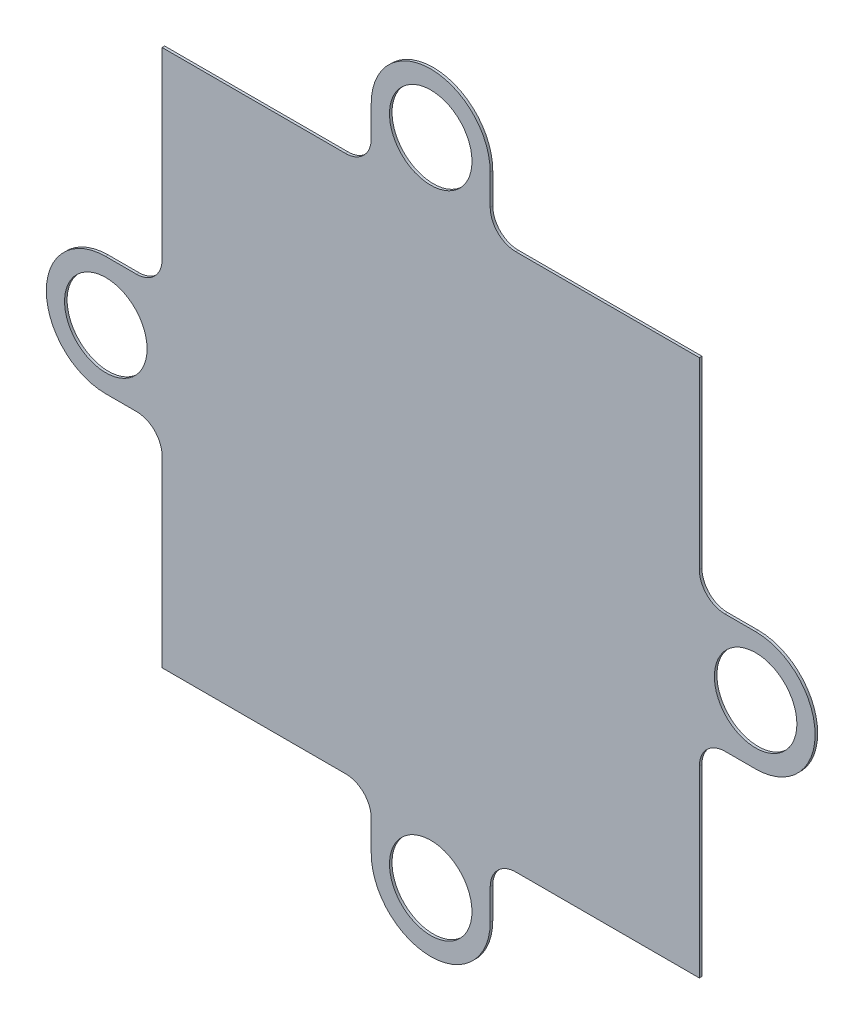
ISO-10303-21;
HEADER;
FILE_DESCRIPTION(('STEP AP214'),'2;1');
FILE_NAME('part.step','',(''),(''),'','','');
FILE_SCHEMA(('AUTOMOTIVE_DESIGN { 1 0 10303 214 1 1 1 1 }'));
ENDSEC;
DATA;
#1=APPLICATION_CONTEXT('core data for automotive mechanical design processes');
#2=APPLICATION_PROTOCOL_DEFINITION('international standard','automotive_design',2000,#1);
#3=PRODUCT_CONTEXT('',#1,'mechanical');
#4=PRODUCT('Part','Part','',(#3));
#5=PRODUCT_RELATED_PRODUCT_CATEGORY('part','',(#4));
#6=PRODUCT_DEFINITION_FORMATION('','',#4);
#7=PRODUCT_DEFINITION_CONTEXT('part definition',#1,'design');
#8=PRODUCT_DEFINITION('design','',#6,#7);
#9=PRODUCT_DEFINITION_SHAPE('','',#8);
#10=(LENGTH_UNIT() NAMED_UNIT(*) SI_UNIT(.MILLI.,.METRE.));
#11=(NAMED_UNIT(*) PLANE_ANGLE_UNIT() SI_UNIT($,.RADIAN.));
#12=(NAMED_UNIT(*) SI_UNIT($,.STERADIAN.) SOLID_ANGLE_UNIT());
#13=UNCERTAINTY_MEASURE_WITH_UNIT(LENGTH_MEASURE(1.E-05),#10,'distance_accuracy_value','');
#14=(GEOMETRIC_REPRESENTATION_CONTEXT(3) GLOBAL_UNCERTAINTY_ASSIGNED_CONTEXT((#13)) GLOBAL_UNIT_ASSIGNED_CONTEXT((#10,
#11,#12)) REPRESENTATION_CONTEXT('',''));
#15=CARTESIAN_POINT('',(0.,0.,0.));
#16=DIRECTION('',(0.,0.,1.));
#17=DIRECTION('',(1.,0.,0.));
#18=AXIS2_PLACEMENT_3D('',#15,#16,#17);
#19=CARTESIAN_POINT('',(0.,-4.64999999999974,0.2));
#20=DIRECTION('',(0.,1.,0.));
#21=DIRECTION('',(0.,0.,1.));
#22=AXIS2_PLACEMENT_3D('',#19,#20,#21);
#23=PLANE('',#22);
#24=DIRECTION('',(1.,0.,0.));
#25=VECTOR('',#24,1.);
#26=CARTESIAN_POINT('',(0.,-4.64999999999974,0.));
#27=LINE('',#26,#25);
#28=CARTESIAN_POINT('',(-25.4000000000001,-4.64999999999974,0.));
#29=VERTEX_POINT('',#28);
#30=CARTESIAN_POINT('',(-23.0000000000001,-4.64999999999974,0.));
#31=VERTEX_POINT('',#30);
#32=EDGE_CURVE('E284',#29,#31,#27,.T.);
#33=ORIENTED_EDGE('',*,*,#32,.T.);
#34=DIRECTION('',(0.,0.,-1.));
#35=VECTOR('',#34,1.);
#36=CARTESIAN_POINT('',(-23.0000000000001,-4.64999999999974,0.2));
#37=LINE('',#36,#35);
#38=CARTESIAN_POINT('',(-23.0000000000001,-4.64999999999974,0.2));
#39=VERTEX_POINT('',#38);
#40=EDGE_CURVE('E11',#39,#31,#37,.T.);
#41=ORIENTED_EDGE('',*,*,#40,.F.);
#42=DIRECTION('',(1.,0.,0.));
#43=VECTOR('',#42,1.);
#44=CARTESIAN_POINT('',(0.,-4.64999999999974,0.2));
#45=LINE('',#44,#43);
#46=CARTESIAN_POINT('',(-25.4000000000001,-4.64999999999974,0.2));
#47=VERTEX_POINT('',#46);
#48=EDGE_CURVE('E490',#47,#39,#45,.T.);
#49=ORIENTED_EDGE('',*,*,#48,.F.);
#50=DIRECTION('',(0.,0.,-1.));
#51=VECTOR('',#50,1.);
#52=CARTESIAN_POINT('',(-25.4000000000001,-4.64999999999974,0.2));
#53=LINE('',#52,#51);
#54=EDGE_CURVE('E264',#47,#29,#53,.T.);
#55=ORIENTED_EDGE('',*,*,#54,.T.);
#56=EDGE_LOOP('',(#33,#41,#49,#55));
#57=FACE_BOUND('',#56,.T.);
#58=ADVANCED_FACE('F47',(#57),#23,.F.);
#59=CARTESIAN_POINT('',(-23.0000000000001,-6.64999999999976,0.2));
#60=DIRECTION('',(0.,0.,-1.));
#61=DIRECTION('',(-1.,0.,0.));
#62=AXIS2_PLACEMENT_3D('',#59,#60,#61);
#63=CYLINDRICAL_SURFACE('',#62,2.00000000000001);
#64=CARTESIAN_POINT('',(-23.0000000000001,-6.64999999999976,0.));
#65=DIRECTION('',(0.,0.,1.));
#66=DIRECTION('',(1.,0.,0.));
#67=AXIS2_PLACEMENT_3D('',#64,#65,#66);
#68=CIRCLE('',#67,2.00000000000001);
#69=CARTESIAN_POINT('',(-21.0000000000001,-6.6499999999998,0.));
#70=VERTEX_POINT('',#69);
#71=EDGE_CURVE('E288',#31,#70,#68,.F.);
#72=ORIENTED_EDGE('',*,*,#71,.T.);
#73=DIRECTION('',(0.,0.,-1.));
#74=VECTOR('',#73,1.);
#75=CARTESIAN_POINT('',(-21.0000000000001,-6.6499999999998,0.2));
#76=LINE('',#75,#74);
#77=CARTESIAN_POINT('',(-21.0000000000001,-6.6499999999998,0.2));
#78=VERTEX_POINT('',#77);
#79=EDGE_CURVE('E57',#78,#70,#76,.T.);
#80=ORIENTED_EDGE('',*,*,#79,.F.);
#81=CARTESIAN_POINT('',(-23.0000000000001,-6.64999999999976,0.2));
#82=DIRECTION('',(0.,0.,1.));
#83=DIRECTION('',(1.,0.,0.));
#84=AXIS2_PLACEMENT_3D('',#81,#82,#83);
#85=CIRCLE('',#84,2.00000000000001);
#86=EDGE_CURVE('E164',#39,#78,#85,.F.);
#87=ORIENTED_EDGE('',*,*,#86,.F.);
#88=ORIENTED_EDGE('',*,*,#40,.T.);
#89=EDGE_LOOP('',(#72,#80,#87,#88));
#90=FACE_BOUND('',#89,.T.);
#91=ADVANCED_FACE('F470',(#90),#63,.F.);
#92=CARTESIAN_POINT('',(-21.0000000000001,-1.01544788837666E-13,0.2));
#93=DIRECTION('',(-1.,0.,0.));
#94=DIRECTION('',(0.,-1.,0.));
#95=AXIS2_PLACEMENT_3D('',#92,#93,#94);
#96=PLANE('',#95);
#97=DIRECTION('',(0.,1.,0.));
#98=VECTOR('',#97,1.);
#99=CARTESIAN_POINT('',(-21.0000000000001,-1.01544788837666E-13,0.));
#100=LINE('',#99,#98);
#101=CARTESIAN_POINT('',(-21.,-21.,0.));
#102=VERTEX_POINT('',#101);
#103=EDGE_CURVE('E292',#102,#70,#100,.T.);
#104=ORIENTED_EDGE('',*,*,#103,.F.);
#105=DIRECTION('',(0.,0.,-1.));
#106=VECTOR('',#105,1.);
#107=CARTESIAN_POINT('',(-21.,-21.,0.2));
#108=LINE('',#107,#106);
#109=CARTESIAN_POINT('',(-21.,-21.,0.2));
#110=VERTEX_POINT('',#109);
#111=EDGE_CURVE('E461',#110,#102,#108,.T.);
#112=ORIENTED_EDGE('',*,*,#111,.F.);
#113=DIRECTION('',(0.,1.,0.));
#114=VECTOR('',#113,1.);
#115=CARTESIAN_POINT('',(-21.0000000000001,-1.01544788837666E-13,0.2));
#116=LINE('',#115,#114);
#117=EDGE_CURVE('E469',#110,#78,#116,.T.);
#118=ORIENTED_EDGE('',*,*,#117,.T.);
#119=ORIENTED_EDGE('',*,*,#79,.T.);
#120=EDGE_LOOP('',(#104,#112,#118,#119));
#121=FACE_BOUND('',#120,.T.);
#122=ADVANCED_FACE('F467',(#121),#96,.T.);
#123=CARTESIAN_POINT('',(1.827806199078E-13,-20.9999999999998,0.2));
#124=DIRECTION('',(0.,1.,0.));
#125=DIRECTION('',(-1.,0.,0.));
#126=AXIS2_PLACEMENT_3D('',#123,#124,#125);
#127=PLANE('',#126);
#128=DIRECTION('',(1.,0.,0.));
#129=VECTOR('',#128,1.);
#130=CARTESIAN_POINT('',(1.827806199078E-13,-20.9999999999998,0.));
#131=LINE('',#130,#129);
#132=CARTESIAN_POINT('',(-6.65000000000012,-20.9999999999999,0.));
#133=VERTEX_POINT('',#132);
#134=EDGE_CURVE('E296',#102,#133,#131,.T.);
#135=ORIENTED_EDGE('',*,*,#134,.T.);
#136=DIRECTION('',(0.,0.,-1.));
#137=VECTOR('',#136,1.);
#138=CARTESIAN_POINT('',(-6.65000000000012,-20.9999999999999,0.2));
#139=LINE('',#138,#137);
#140=CARTESIAN_POINT('',(-6.65000000000012,-20.9999999999999,0.2));
#141=VERTEX_POINT('',#140);
#142=EDGE_CURVE('E458',#141,#133,#139,.T.);
#143=ORIENTED_EDGE('',*,*,#142,.F.);
#144=DIRECTION('',(1.,0.,0.));
#145=VECTOR('',#144,1.);
#146=CARTESIAN_POINT('',(1.827806199078E-13,-20.9999999999998,0.2));
#147=LINE('',#146,#145);
#148=EDGE_CURVE('E482',#110,#141,#147,.T.);
#149=ORIENTED_EDGE('',*,*,#148,.F.);
#150=ORIENTED_EDGE('',*,*,#111,.T.);
#151=EDGE_LOOP('',(#135,#143,#149,#150));
#152=FACE_BOUND('',#151,.T.);
#153=ADVANCED_FACE('F479',(#152),#127,.F.);
#154=CARTESIAN_POINT('',(-6.65000000000008,-22.9999999999999,0.2));
#155=DIRECTION('',(0.,0.,-1.));
#156=DIRECTION('',(-1.,0.,0.));
#157=AXIS2_PLACEMENT_3D('',#154,#155,#156);
#158=CYLINDRICAL_SURFACE('',#157,2.);
#159=CARTESIAN_POINT('',(-6.65000000000008,-22.9999999999999,0.));
#160=DIRECTION('',(0.,0.,1.));
#161=DIRECTION('',(1.,0.,0.));
#162=AXIS2_PLACEMENT_3D('',#159,#160,#161);
#163=CIRCLE('',#162,2.);
#164=CARTESIAN_POINT('',(-4.65000000000009,-22.9999999999999,0.));
#165=VERTEX_POINT('',#164);
#166=EDGE_CURVE('E300',#165,#133,#163,.T.);
#167=ORIENTED_EDGE('',*,*,#166,.F.);
#168=DIRECTION('',(0.,0.,-1.));
#169=VECTOR('',#168,1.);
#170=CARTESIAN_POINT('',(-4.65000000000009,-22.9999999999999,0.2));
#171=LINE('',#170,#169);
#172=CARTESIAN_POINT('',(-4.65000000000009,-22.9999999999999,0.2));
#173=VERTEX_POINT('',#172);
#174=EDGE_CURVE('E455',#173,#165,#171,.T.);
#175=ORIENTED_EDGE('',*,*,#174,.F.);
#176=CARTESIAN_POINT('',(-6.65000000000008,-22.9999999999999,0.2));
#177=DIRECTION('',(0.,0.,1.));
#178=DIRECTION('',(1.,0.,0.));
#179=AXIS2_PLACEMENT_3D('',#176,#177,#178);
#180=CIRCLE('',#179,2.);
#181=EDGE_CURVE('E485',#173,#141,#180,.T.);
#182=ORIENTED_EDGE('',*,*,#181,.T.);
#183=ORIENTED_EDGE('',*,*,#142,.T.);
#184=EDGE_LOOP('',(#167,#175,#182,#183));
#185=FACE_BOUND('',#184,.T.);
#186=ADVANCED_FACE('F843',(#185),#158,.F.);
#187=CARTESIAN_POINT('',(-4.65000000000009,0.,0.2));
#188=DIRECTION('',(-1.,0.,0.));
#189=DIRECTION('',(0.,0.,1.));
#190=AXIS2_PLACEMENT_3D('',#187,#188,#189);
#191=PLANE('',#190);
#192=DIRECTION('',(0.,1.,0.));
#193=VECTOR('',#192,1.);
#194=CARTESIAN_POINT('',(-4.65000000000009,0.,0.));
#195=LINE('',#194,#193);
#196=CARTESIAN_POINT('',(-4.65000000000009,-25.4,0.));
#197=VERTEX_POINT('',#196);
#198=EDGE_CURVE('E304',#197,#165,#195,.T.);
#199=ORIENTED_EDGE('',*,*,#198,.F.);
#200=DIRECTION('',(0.,0.,-1.));
#201=VECTOR('',#200,1.);
#202=CARTESIAN_POINT('',(-4.65000000000009,-25.4,0.2));
#203=LINE('',#202,#201);
#204=CARTESIAN_POINT('',(-4.65000000000009,-25.4,0.2));
#205=VERTEX_POINT('',#204);
#206=EDGE_CURVE('E452',#205,#197,#203,.T.);
#207=ORIENTED_EDGE('',*,*,#206,.F.);
#208=DIRECTION('',(0.,1.,0.));
#209=VECTOR('',#208,1.);
#210=CARTESIAN_POINT('',(-4.65000000000009,0.,0.2));
#211=LINE('',#210,#209);
#212=EDGE_CURVE('E496',#205,#173,#211,.T.);
#213=ORIENTED_EDGE('',*,*,#212,.T.);
#214=ORIENTED_EDGE('',*,*,#174,.T.);
#215=EDGE_LOOP('',(#199,#207,#213,#214));
#216=FACE_BOUND('',#215,.T.);
#217=ADVANCED_FACE('F834',(#216),#191,.T.);
#218=CARTESIAN_POINT('',(0.,-25.4,0.2));
#219=DIRECTION('',(0.,0.,-1.));
#220=DIRECTION('',(-1.,0.,0.));
#221=AXIS2_PLACEMENT_3D('',#218,#219,#220);
#222=CYLINDRICAL_SURFACE('',#221,4.65);
#223=CARTESIAN_POINT('',(0.,-25.4,0.));
#224=DIRECTION('',(0.,0.,1.));
#225=DIRECTION('',(1.,0.,0.));
#226=AXIS2_PLACEMENT_3D('',#223,#224,#225);
#227=CIRCLE('',#226,4.65);
#228=CARTESIAN_POINT('',(4.64999999999991,-25.4,0.));
#229=VERTEX_POINT('',#228);
#230=EDGE_CURVE('E308',#197,#229,#227,.T.);
#231=ORIENTED_EDGE('',*,*,#230,.T.);
#232=DIRECTION('',(0.,0.,-1.));
#233=VECTOR('',#232,1.);
#234=CARTESIAN_POINT('',(4.64999999999991,-25.4,0.2));
#235=LINE('',#234,#233);
#236=CARTESIAN_POINT('',(4.64999999999991,-25.4,0.2));
#237=VERTEX_POINT('',#236);
#238=EDGE_CURVE('E448',#237,#229,#235,.T.);
#239=ORIENTED_EDGE('',*,*,#238,.F.);
#240=CARTESIAN_POINT('',(0.,-25.4,0.2));
#241=DIRECTION('',(0.,0.,1.));
#242=DIRECTION('',(1.,0.,0.));
#243=AXIS2_PLACEMENT_3D('',#240,#241,#242);
#244=CIRCLE('',#243,4.65);
#245=EDGE_CURVE('E500',#205,#237,#244,.T.);
#246=ORIENTED_EDGE('',*,*,#245,.F.);
#247=ORIENTED_EDGE('',*,*,#206,.T.);
#248=EDGE_LOOP('',(#231,#239,#246,#247));
#249=FACE_BOUND('',#248,.T.);
#250=ADVANCED_FACE('F825',(#249),#222,.T.);
#251=CARTESIAN_POINT('',(4.64999999999991,0.,0.2));
#252=DIRECTION('',(-1.,0.,0.));
#253=DIRECTION('',(0.,0.,1.));
#254=AXIS2_PLACEMENT_3D('',#251,#252,#253);
#255=PLANE('',#254);
#256=DIRECTION('',(0.,1.,0.));
#257=VECTOR('',#256,1.);
#258=CARTESIAN_POINT('',(4.64999999999991,0.,0.));
#259=LINE('',#258,#257);
#260=CARTESIAN_POINT('',(4.64999999999991,-22.9999999999999,0.));
#261=VERTEX_POINT('',#260);
#262=EDGE_CURVE('E311',#229,#261,#259,.T.);
#263=ORIENTED_EDGE('',*,*,#262,.T.);
#264=DIRECTION('',(0.,0.,-1.));
#265=VECTOR('',#264,1.);
#266=CARTESIAN_POINT('',(4.64999999999991,-22.9999999999999,0.2));
#267=LINE('',#266,#265);
#268=CARTESIAN_POINT('',(4.64999999999991,-22.9999999999999,0.2));
#269=VERTEX_POINT('',#268);
#270=EDGE_CURVE('E444',#269,#261,#267,.T.);
#271=ORIENTED_EDGE('',*,*,#270,.F.);
#272=DIRECTION('',(0.,1.,0.));
#273=VECTOR('',#272,1.);
#274=CARTESIAN_POINT('',(4.64999999999991,0.,0.2));
#275=LINE('',#274,#273);
#276=EDGE_CURVE('E503',#237,#269,#275,.T.);
#277=ORIENTED_EDGE('',*,*,#276,.F.);
#278=ORIENTED_EDGE('',*,*,#238,.T.);
#279=EDGE_LOOP('',(#263,#271,#277,#278));
#280=FACE_BOUND('',#279,.T.);
#281=ADVANCED_FACE('F816',(#280),#255,.F.);
#282=CARTESIAN_POINT('',(6.6499999999999,-22.9999999999999,0.2));
#283=DIRECTION('',(0.,0.,-1.));
#284=DIRECTION('',(-1.,0.,0.));
#285=AXIS2_PLACEMENT_3D('',#282,#283,#284);
#286=CYLINDRICAL_SURFACE('',#285,2.);
#287=CARTESIAN_POINT('',(6.6499999999999,-22.9999999999999,0.));
#288=DIRECTION('',(0.,0.,1.));
#289=DIRECTION('',(1.,0.,0.));
#290=AXIS2_PLACEMENT_3D('',#287,#288,#289);
#291=CIRCLE('',#290,2.);
#292=CARTESIAN_POINT('',(6.64999999999994,-20.9999999999999,0.));
#293=VERTEX_POINT('',#292);
#294=EDGE_CURVE('E314',#261,#293,#291,.F.);
#295=ORIENTED_EDGE('',*,*,#294,.T.);
#296=DIRECTION('',(0.,0.,-1.));
#297=VECTOR('',#296,1.);
#298=CARTESIAN_POINT('',(6.64999999999994,-20.9999999999999,0.2));
#299=LINE('',#298,#297);
#300=CARTESIAN_POINT('',(6.64999999999994,-20.9999999999999,0.2));
#301=VERTEX_POINT('',#300);
#302=EDGE_CURVE('E440',#301,#293,#299,.T.);
#303=ORIENTED_EDGE('',*,*,#302,.F.);
#304=CARTESIAN_POINT('',(6.6499999999999,-22.9999999999999,0.2));
#305=DIRECTION('',(0.,0.,1.));
#306=DIRECTION('',(1.,0.,0.));
#307=AXIS2_PLACEMENT_3D('',#304,#305,#306);
#308=CIRCLE('',#307,2.);
#309=EDGE_CURVE('E506',#269,#301,#308,.F.);
#310=ORIENTED_EDGE('',*,*,#309,.F.);
#311=ORIENTED_EDGE('',*,*,#270,.T.);
#312=EDGE_LOOP('',(#295,#303,#310,#311));
#313=FACE_BOUND('',#312,.T.);
#314=ADVANCED_FACE('F807',(#313),#286,.F.);
#315=CARTESIAN_POINT('',(0.,-20.9999999999999,0.2));
#316=DIRECTION('',(0.,1.,0.));
#317=DIRECTION('',(0.,0.,1.));
#318=AXIS2_PLACEMENT_3D('',#315,#316,#317);
#319=PLANE('',#318);
#320=DIRECTION('',(1.,0.,0.));
#321=VECTOR('',#320,1.);
#322=CARTESIAN_POINT('',(0.,-20.9999999999999,0.));
#323=LINE('',#322,#321);
#324=CARTESIAN_POINT('',(21.,-21.,0.));
#325=VERTEX_POINT('',#324);
#326=EDGE_CURVE('E317',#293,#325,#323,.T.);
#327=ORIENTED_EDGE('',*,*,#326,.T.);
#328=DIRECTION('',(0.,0.,-1.));
#329=VECTOR('',#328,1.);
#330=CARTESIAN_POINT('',(21.,-21.,0.2));
#331=LINE('',#330,#329);
#332=CARTESIAN_POINT('',(21.,-21.,0.2));
#333=VERTEX_POINT('',#332);
#334=EDGE_CURVE('E436',#333,#325,#331,.T.);
#335=ORIENTED_EDGE('',*,*,#334,.F.);
#336=DIRECTION('',(1.,0.,0.));
#337=VECTOR('',#336,1.);
#338=CARTESIAN_POINT('',(0.,-20.9999999999999,0.2));
#339=LINE('',#338,#337);
#340=EDGE_CURVE('E509',#301,#333,#339,.T.);
#341=ORIENTED_EDGE('',*,*,#340,.F.);
#342=ORIENTED_EDGE('',*,*,#302,.T.);
#343=EDGE_LOOP('',(#327,#335,#341,#342));
#344=FACE_BOUND('',#343,.T.);
#345=ADVANCED_FACE('F798',(#344),#319,.F.);
#346=CARTESIAN_POINT('',(21.,0.,0.2));
#347=DIRECTION('',(-1.,0.,0.));
#348=DIRECTION('',(0.,-1.,0.));
#349=AXIS2_PLACEMENT_3D('',#346,#347,#348);
#350=PLANE('',#349);
#351=DIRECTION('',(0.,1.,0.));
#352=VECTOR('',#351,1.);
#353=CARTESIAN_POINT('',(21.,0.,0.));
#354=LINE('',#353,#352);
#355=CARTESIAN_POINT('',(21.,-6.6500000000001,0.));
#356=VERTEX_POINT('',#355);
#357=EDGE_CURVE('E320',#325,#356,#354,.T.);
#358=ORIENTED_EDGE('',*,*,#357,.T.);
#359=DIRECTION('',(0.,0.,-1.));
#360=VECTOR('',#359,1.);
#361=CARTESIAN_POINT('',(21.,-6.6500000000001,0.2));
#362=LINE('',#361,#360);
#363=CARTESIAN_POINT('',(21.,-6.6500000000001,0.2));
#364=VERTEX_POINT('',#363);
#365=EDGE_CURVE('E433',#364,#356,#362,.T.);
#366=ORIENTED_EDGE('',*,*,#365,.F.);
#367=DIRECTION('',(0.,1.,0.));
#368=VECTOR('',#367,1.);
#369=CARTESIAN_POINT('',(21.,0.,0.2));
#370=LINE('',#369,#368);
#371=EDGE_CURVE('E512',#333,#364,#370,.T.);
#372=ORIENTED_EDGE('',*,*,#371,.F.);
#373=ORIENTED_EDGE('',*,*,#334,.T.);
#374=EDGE_LOOP('',(#358,#366,#372,#373));
#375=FACE_BOUND('',#374,.T.);
#376=ADVANCED_FACE('F789',(#375),#350,.F.);
#377=CARTESIAN_POINT('',(23.,-6.65000000000009,0.2));
#378=DIRECTION('',(0.,0.,-1.));
#379=DIRECTION('',(-1.,0.,0.));
#380=AXIS2_PLACEMENT_3D('',#377,#378,#379);
#381=CYLINDRICAL_SURFACE('',#380,2.);
#382=CARTESIAN_POINT('',(23.,-6.65000000000009,0.));
#383=DIRECTION('',(0.,0.,1.));
#384=DIRECTION('',(1.,0.,0.));
#385=AXIS2_PLACEMENT_3D('',#382,#383,#384);
#386=CIRCLE('',#385,2.);
#387=CARTESIAN_POINT('',(23.,-4.6500000000001,0.));
#388=VERTEX_POINT('',#387);
#389=EDGE_CURVE('E324',#388,#356,#386,.T.);
#390=ORIENTED_EDGE('',*,*,#389,.F.);
#391=DIRECTION('',(0.,0.,-1.));
#392=VECTOR('',#391,1.);
#393=CARTESIAN_POINT('',(23.,-4.6500000000001,0.2));
#394=LINE('',#393,#392);
#395=CARTESIAN_POINT('',(23.,-4.6500000000001,0.2));
#396=VERTEX_POINT('',#395);
#397=EDGE_CURVE('E430',#396,#388,#394,.T.);
#398=ORIENTED_EDGE('',*,*,#397,.F.);
#399=CARTESIAN_POINT('',(23.,-6.65000000000009,0.2));
#400=DIRECTION('',(0.,0.,1.));
#401=DIRECTION('',(1.,0.,0.));
#402=AXIS2_PLACEMENT_3D('',#399,#400,#401);
#403=CIRCLE('',#402,2.);
#404=EDGE_CURVE('E515',#396,#364,#403,.T.);
#405=ORIENTED_EDGE('',*,*,#404,.T.);
#406=ORIENTED_EDGE('',*,*,#365,.T.);
#407=EDGE_LOOP('',(#390,#398,#405,#406));
#408=FACE_BOUND('',#407,.T.);
#409=ADVANCED_FACE('F780',(#408),#381,.F.);
#410=CARTESIAN_POINT('',(0.,-4.6500000000001,0.2));
#411=DIRECTION('',(0.,-1.,0.));
#412=DIRECTION('',(0.,0.,-1.));
#413=AXIS2_PLACEMENT_3D('',#410,#411,#412);
#414=PLANE('',#413);
#415=DIRECTION('',(-1.,0.,0.));
#416=VECTOR('',#415,1.);
#417=CARTESIAN_POINT('',(0.,-4.6500000000001,0.));
#418=LINE('',#417,#416);
#419=CARTESIAN_POINT('',(25.4000000000001,-4.6500000000001,0.));
#420=VERTEX_POINT('',#419);
#421=EDGE_CURVE('E328',#420,#388,#418,.T.);
#422=ORIENTED_EDGE('',*,*,#421,.F.);
#423=DIRECTION('',(0.,0.,-1.));
#424=VECTOR('',#423,1.);
#425=CARTESIAN_POINT('',(25.4000000000001,-4.6500000000001,0.2));
#426=LINE('',#425,#424);
#427=CARTESIAN_POINT('',(25.4000000000001,-4.6500000000001,0.2));
#428=VERTEX_POINT('',#427);
#429=EDGE_CURVE('E427',#428,#420,#426,.T.);
#430=ORIENTED_EDGE('',*,*,#429,.F.);
#431=DIRECTION('',(-1.,0.,0.));
#432=VECTOR('',#431,1.);
#433=CARTESIAN_POINT('',(0.,-4.6500000000001,0.2));
#434=LINE('',#433,#432);
#435=EDGE_CURVE('E519',#428,#396,#434,.T.);
#436=ORIENTED_EDGE('',*,*,#435,.T.);
#437=ORIENTED_EDGE('',*,*,#397,.T.);
#438=EDGE_LOOP('',(#422,#430,#436,#437));
#439=FACE_BOUND('',#438,.T.);
#440=ADVANCED_FACE('F771',(#439),#414,.T.);
#441=CARTESIAN_POINT('',(25.4000000000001,0.,0.2));
#442=DIRECTION('',(0.,0.,-1.));
#443=DIRECTION('',(-1.,0.,0.));
#444=AXIS2_PLACEMENT_3D('',#441,#442,#443);
#445=CYLINDRICAL_SURFACE('',#444,4.65);
#446=CARTESIAN_POINT('',(25.4000000000001,0.,0.));
#447=DIRECTION('',(0.,0.,1.));
#448=DIRECTION('',(1.,0.,0.));
#449=AXIS2_PLACEMENT_3D('',#446,#447,#448);
#450=CIRCLE('',#449,4.65);
#451=CARTESIAN_POINT('',(25.4000000000001,4.6499999999999,0.));
#452=VERTEX_POINT('',#451);
#453=EDGE_CURVE('E332',#420,#452,#450,.T.);
#454=ORIENTED_EDGE('',*,*,#453,.T.);
#455=DIRECTION('',(0.,0.,-1.));
#456=VECTOR('',#455,1.);
#457=CARTESIAN_POINT('',(25.4000000000001,4.6499999999999,0.2));
#458=LINE('',#457,#456);
#459=CARTESIAN_POINT('',(25.4000000000001,4.6499999999999,0.2));
#460=VERTEX_POINT('',#459);
#461=EDGE_CURVE('E423',#460,#452,#458,.T.);
#462=ORIENTED_EDGE('',*,*,#461,.F.);
#463=CARTESIAN_POINT('',(25.4000000000001,0.,0.2));
#464=DIRECTION('',(0.,0.,1.));
#465=DIRECTION('',(1.,0.,0.));
#466=AXIS2_PLACEMENT_3D('',#463,#464,#465);
#467=CIRCLE('',#466,4.65);
#468=EDGE_CURVE('E523',#428,#460,#467,.T.);
#469=ORIENTED_EDGE('',*,*,#468,.F.);
#470=ORIENTED_EDGE('',*,*,#429,.T.);
#471=EDGE_LOOP('',(#454,#462,#469,#470));
#472=FACE_BOUND('',#471,.T.);
#473=ADVANCED_FACE('F762',(#472),#445,.T.);
#474=CARTESIAN_POINT('',(0.,4.6499999999999,0.2));
#475=DIRECTION('',(0.,-1.,0.));
#476=DIRECTION('',(0.,0.,-1.));
#477=AXIS2_PLACEMENT_3D('',#474,#475,#476);
#478=PLANE('',#477);
#479=DIRECTION('',(-1.,0.,0.));
#480=VECTOR('',#479,1.);
#481=CARTESIAN_POINT('',(0.,4.6499999999999,0.));
#482=LINE('',#481,#480);
#483=CARTESIAN_POINT('',(23.,4.6499999999999,0.));
#484=VERTEX_POINT('',#483);
#485=EDGE_CURVE('E335',#452,#484,#482,.T.);
#486=ORIENTED_EDGE('',*,*,#485,.T.);
#487=DIRECTION('',(0.,0.,-1.));
#488=VECTOR('',#487,1.);
#489=CARTESIAN_POINT('',(23.,4.6499999999999,0.2));
#490=LINE('',#489,#488);
#491=CARTESIAN_POINT('',(23.,4.6499999999999,0.2));
#492=VERTEX_POINT('',#491);
#493=EDGE_CURVE('E419',#492,#484,#490,.T.);
#494=ORIENTED_EDGE('',*,*,#493,.F.);
#495=DIRECTION('',(-1.,0.,0.));
#496=VECTOR('',#495,1.);
#497=CARTESIAN_POINT('',(0.,4.6499999999999,0.2));
#498=LINE('',#497,#496);
#499=EDGE_CURVE('E526',#460,#492,#498,.T.);
#500=ORIENTED_EDGE('',*,*,#499,.F.);
#501=ORIENTED_EDGE('',*,*,#461,.T.);
#502=EDGE_LOOP('',(#486,#494,#500,#501));
#503=FACE_BOUND('',#502,.T.);
#504=ADVANCED_FACE('F753',(#503),#478,.F.);
#505=CARTESIAN_POINT('',(23.,6.64999999999991,0.2));
#506=DIRECTION('',(0.,0.,-1.));
#507=DIRECTION('',(-1.,0.,0.));
#508=AXIS2_PLACEMENT_3D('',#505,#506,#507);
#509=CYLINDRICAL_SURFACE('',#508,2.00000000000001);
#510=CARTESIAN_POINT('',(23.,6.64999999999991,0.));
#511=DIRECTION('',(0.,0.,1.));
#512=DIRECTION('',(1.,0.,0.));
#513=AXIS2_PLACEMENT_3D('',#510,#511,#512);
#514=CIRCLE('',#513,2.00000000000001);
#515=CARTESIAN_POINT('',(21.,6.64999999999993,0.));
#516=VERTEX_POINT('',#515);
#517=EDGE_CURVE('E338',#484,#516,#514,.F.);
#518=ORIENTED_EDGE('',*,*,#517,.T.);
#519=DIRECTION('',(0.,0.,-1.));
#520=VECTOR('',#519,1.);
#521=CARTESIAN_POINT('',(21.,6.64999999999993,0.2));
#522=LINE('',#521,#520);
#523=CARTESIAN_POINT('',(21.,6.64999999999993,0.2));
#524=VERTEX_POINT('',#523);
#525=EDGE_CURVE('E415',#524,#516,#522,.T.);
#526=ORIENTED_EDGE('',*,*,#525,.F.);
#527=CARTESIAN_POINT('',(23.,6.64999999999991,0.2));
#528=DIRECTION('',(0.,0.,1.));
#529=DIRECTION('',(1.,0.,0.));
#530=AXIS2_PLACEMENT_3D('',#527,#528,#529);
#531=CIRCLE('',#530,2.00000000000001);
#532=EDGE_CURVE('E529',#492,#524,#531,.F.);
#533=ORIENTED_EDGE('',*,*,#532,.F.);
#534=ORIENTED_EDGE('',*,*,#493,.T.);
#535=EDGE_LOOP('',(#518,#526,#533,#534));
#536=FACE_BOUND('',#535,.T.);
#537=ADVANCED_FACE('F744',(#536),#509,.F.);
#538=CARTESIAN_POINT('',(21.,0.,0.2));
#539=DIRECTION('',(-1.,0.,0.));
#540=DIRECTION('',(0.,0.,1.));
#541=AXIS2_PLACEMENT_3D('',#538,#539,#540);
#542=PLANE('',#541);
#543=DIRECTION('',(0.,1.,0.));
#544=VECTOR('',#543,1.);
#545=CARTESIAN_POINT('',(21.,0.,0.));
#546=LINE('',#545,#544);
#547=CARTESIAN_POINT('',(21.,21.,0.));
#548=VERTEX_POINT('',#547);
#549=EDGE_CURVE('E341',#516,#548,#546,.T.);
#550=ORIENTED_EDGE('',*,*,#549,.T.);
#551=DIRECTION('',(0.,0.,-1.));
#552=VECTOR('',#551,1.);
#553=CARTESIAN_POINT('',(21.,21.,0.2));
#554=LINE('',#553,#552);
#555=CARTESIAN_POINT('',(21.,21.,0.2));
#556=VERTEX_POINT('',#555);
#557=EDGE_CURVE('E412',#556,#548,#554,.T.);
#558=ORIENTED_EDGE('',*,*,#557,.F.);
#559=DIRECTION('',(0.,1.,0.));
#560=VECTOR('',#559,1.);
#561=CARTESIAN_POINT('',(21.,0.,0.2));
#562=LINE('',#561,#560);
#563=EDGE_CURVE('E532',#524,#556,#562,.T.);
#564=ORIENTED_EDGE('',*,*,#563,.F.);
#565=ORIENTED_EDGE('',*,*,#525,.T.);
#566=EDGE_LOOP('',(#550,#558,#564,#565));
#567=FACE_BOUND('',#566,.T.);
#568=ADVANCED_FACE('F735',(#567),#542,.F.);
#569=CARTESIAN_POINT('',(0.,21.,0.2));
#570=DIRECTION('',(0.,1.,0.));
#571=DIRECTION('',(0.,0.,1.));
#572=AXIS2_PLACEMENT_3D('',#569,#570,#571);
#573=PLANE('',#572);
#574=DIRECTION('',(1.,0.,0.));
#575=VECTOR('',#574,1.);
#576=CARTESIAN_POINT('',(0.,21.,0.));
#577=LINE('',#576,#575);
#578=CARTESIAN_POINT('',(6.65000000000001,21.,0.));
#579=VERTEX_POINT('',#578);
#580=EDGE_CURVE('E345',#579,#548,#577,.T.);
#581=ORIENTED_EDGE('',*,*,#580,.F.);
#582=DIRECTION('',(0.,0.,-1.));
#583=VECTOR('',#582,1.);
#584=CARTESIAN_POINT('',(6.65000000000001,21.,0.2));
#585=LINE('',#584,#583);
#586=CARTESIAN_POINT('',(6.65000000000001,21.,0.2));
#587=VERTEX_POINT('',#586);
#588=EDGE_CURVE('E409',#587,#579,#585,.T.);
#589=ORIENTED_EDGE('',*,*,#588,.F.);
#590=DIRECTION('',(1.,0.,0.));
#591=VECTOR('',#590,1.);
#592=CARTESIAN_POINT('',(0.,21.,0.2));
#593=LINE('',#592,#591);
#594=EDGE_CURVE('E535',#587,#556,#593,.T.);
#595=ORIENTED_EDGE('',*,*,#594,.T.);
#596=ORIENTED_EDGE('',*,*,#557,.T.);
#597=EDGE_LOOP('',(#581,#589,#595,#596));
#598=FACE_BOUND('',#597,.T.);
#599=ADVANCED_FACE('F726',(#598),#573,.T.);
#600=CARTESIAN_POINT('',(6.65000000000001,23.,0.2));
#601=DIRECTION('',(0.,0.,-1.));
#602=DIRECTION('',(-1.,0.,0.));
#603=AXIS2_PLACEMENT_3D('',#600,#601,#602);
#604=CYLINDRICAL_SURFACE('',#603,2.);
#605=CARTESIAN_POINT('',(6.65000000000001,23.,0.));
#606=DIRECTION('',(0.,0.,1.));
#607=DIRECTION('',(1.,0.,0.));
#608=AXIS2_PLACEMENT_3D('',#605,#606,#607);
#609=CIRCLE('',#608,2.);
#610=CARTESIAN_POINT('',(4.65,23.,0.));
#611=VERTEX_POINT('',#610);
#612=EDGE_CURVE('E349',#611,#579,#609,.T.);
#613=ORIENTED_EDGE('',*,*,#612,.F.);
#614=DIRECTION('',(0.,0.,-1.));
#615=VECTOR('',#614,1.);
#616=CARTESIAN_POINT('',(4.65,23.,0.2));
#617=LINE('',#616,#615);
#618=CARTESIAN_POINT('',(4.65,23.,0.2));
#619=VERTEX_POINT('',#618);
#620=EDGE_CURVE('E406',#619,#611,#617,.T.);
#621=ORIENTED_EDGE('',*,*,#620,.F.);
#622=CARTESIAN_POINT('',(6.65000000000001,23.,0.2));
#623=DIRECTION('',(0.,0.,1.));
#624=DIRECTION('',(1.,0.,0.));
#625=AXIS2_PLACEMENT_3D('',#622,#623,#624);
#626=CIRCLE('',#625,2.);
#627=EDGE_CURVE('E539',#619,#587,#626,.T.);
#628=ORIENTED_EDGE('',*,*,#627,.T.);
#629=ORIENTED_EDGE('',*,*,#588,.T.);
#630=EDGE_LOOP('',(#613,#621,#628,#629));
#631=FACE_BOUND('',#630,.T.);
#632=ADVANCED_FACE('F717',(#631),#604,.F.);
#633=CARTESIAN_POINT('',(4.65,0.,0.2));
#634=DIRECTION('',(1.,0.,0.));
#635=DIRECTION('',(0.,0.,-1.));
#636=AXIS2_PLACEMENT_3D('',#633,#634,#635);
#637=PLANE('',#636);
#638=DIRECTION('',(0.,-1.,0.));
#639=VECTOR('',#638,1.);
#640=CARTESIAN_POINT('',(4.65,0.,0.));
#641=LINE('',#640,#639);
#642=CARTESIAN_POINT('',(4.65,25.4000000000001,0.));
#643=VERTEX_POINT('',#642);
#644=EDGE_CURVE('E353',#643,#611,#641,.T.);
#645=ORIENTED_EDGE('',*,*,#644,.F.);
#646=DIRECTION('',(0.,0.,-1.));
#647=VECTOR('',#646,1.);
#648=CARTESIAN_POINT('',(4.65,25.4000000000001,0.2));
#649=LINE('',#648,#647);
#650=CARTESIAN_POINT('',(4.65,25.4000000000001,0.2));
#651=VERTEX_POINT('',#650);
#652=EDGE_CURVE('E403',#651,#643,#649,.T.);
#653=ORIENTED_EDGE('',*,*,#652,.F.);
#654=DIRECTION('',(0.,-1.,0.));
#655=VECTOR('',#654,1.);
#656=CARTESIAN_POINT('',(4.65,0.,0.2));
#657=LINE('',#656,#655);
#658=EDGE_CURVE('E543',#651,#619,#657,.T.);
#659=ORIENTED_EDGE('',*,*,#658,.T.);
#660=ORIENTED_EDGE('',*,*,#620,.T.);
#661=EDGE_LOOP('',(#645,#653,#659,#660));
#662=FACE_BOUND('',#661,.T.);
#663=ADVANCED_FACE('F708',(#662),#637,.T.);
#664=CARTESIAN_POINT('',(0.,25.4000000000001,0.2));
#665=DIRECTION('',(0.,0.,-1.));
#666=DIRECTION('',(-1.,0.,0.));
#667=AXIS2_PLACEMENT_3D('',#664,#665,#666);
#668=CYLINDRICAL_SURFACE('',#667,4.65);
#669=CARTESIAN_POINT('',(0.,25.4000000000001,0.));
#670=DIRECTION('',(0.,0.,1.));
#671=DIRECTION('',(1.,0.,0.));
#672=AXIS2_PLACEMENT_3D('',#669,#670,#671);
#673=CIRCLE('',#672,4.65);
#674=CARTESIAN_POINT('',(-4.65,25.4000000000001,0.));
#675=VERTEX_POINT('',#674);
#676=EDGE_CURVE('E357',#643,#675,#673,.T.);
#677=ORIENTED_EDGE('',*,*,#676,.T.);
#678=DIRECTION('',(0.,0.,-1.));
#679=VECTOR('',#678,1.);
#680=CARTESIAN_POINT('',(-4.65,25.4000000000001,0.2));
#681=LINE('',#680,#679);
#682=CARTESIAN_POINT('',(-4.65,25.4000000000001,0.2));
#683=VERTEX_POINT('',#682);
#684=EDGE_CURVE('E399',#683,#675,#681,.T.);
#685=ORIENTED_EDGE('',*,*,#684,.F.);
#686=CARTESIAN_POINT('',(0.,25.4000000000001,0.2));
#687=DIRECTION('',(0.,0.,1.));
#688=DIRECTION('',(1.,0.,0.));
#689=AXIS2_PLACEMENT_3D('',#686,#687,#688);
#690=CIRCLE('',#689,4.65);
#691=EDGE_CURVE('E547',#651,#683,#690,.T.);
#692=ORIENTED_EDGE('',*,*,#691,.F.);
#693=ORIENTED_EDGE('',*,*,#652,.T.);
#694=EDGE_LOOP('',(#677,#685,#692,#693));
#695=FACE_BOUND('',#694,.T.);
#696=ADVANCED_FACE('F699',(#695),#668,.T.);
#697=CARTESIAN_POINT('',(-4.65,0.,0.2));
#698=DIRECTION('',(1.,0.,0.));
#699=DIRECTION('',(0.,0.,-1.));
#700=AXIS2_PLACEMENT_3D('',#697,#698,#699);
#701=PLANE('',#700);
#702=DIRECTION('',(0.,-1.,0.));
#703=VECTOR('',#702,1.);
#704=CARTESIAN_POINT('',(-4.65,0.,0.));
#705=LINE('',#704,#703);
#706=CARTESIAN_POINT('',(-4.65,23.,0.));
#707=VERTEX_POINT('',#706);
#708=EDGE_CURVE('E360',#675,#707,#705,.T.);
#709=ORIENTED_EDGE('',*,*,#708,.T.);
#710=DIRECTION('',(0.,0.,-1.));
#711=VECTOR('',#710,1.);
#712=CARTESIAN_POINT('',(-4.65,23.,0.2));
#713=LINE('',#712,#711);
#714=CARTESIAN_POINT('',(-4.65,23.,0.2));
#715=VERTEX_POINT('',#714);
#716=EDGE_CURVE('E395',#715,#707,#713,.T.);
#717=ORIENTED_EDGE('',*,*,#716,.F.);
#718=DIRECTION('',(0.,-1.,0.));
#719=VECTOR('',#718,1.);
#720=CARTESIAN_POINT('',(-4.65,0.,0.2));
#721=LINE('',#720,#719);
#722=EDGE_CURVE('E550',#683,#715,#721,.T.);
#723=ORIENTED_EDGE('',*,*,#722,.F.);
#724=ORIENTED_EDGE('',*,*,#684,.T.);
#725=EDGE_LOOP('',(#709,#717,#723,#724));
#726=FACE_BOUND('',#725,.T.);
#727=ADVANCED_FACE('F690',(#726),#701,.F.);
#728=CARTESIAN_POINT('',(-6.65,23.,0.2));
#729=DIRECTION('',(0.,0.,-1.));
#730=DIRECTION('',(-1.,0.,0.));
#731=AXIS2_PLACEMENT_3D('',#728,#729,#730);
#732=CYLINDRICAL_SURFACE('',#731,2.);
#733=CARTESIAN_POINT('',(-6.65,23.,0.));
#734=DIRECTION('',(0.,0.,1.));
#735=DIRECTION('',(1.,0.,0.));
#736=AXIS2_PLACEMENT_3D('',#733,#734,#735);
#737=CIRCLE('',#736,2.);
#738=CARTESIAN_POINT('',(-6.65,21.,0.));
#739=VERTEX_POINT('',#738);
#740=EDGE_CURVE('E363',#707,#739,#737,.F.);
#741=ORIENTED_EDGE('',*,*,#740,.T.);
#742=DIRECTION('',(0.,0.,-1.));
#743=VECTOR('',#742,1.);
#744=CARTESIAN_POINT('',(-6.65,21.,0.2));
#745=LINE('',#744,#743);
#746=CARTESIAN_POINT('',(-6.65,21.,0.2));
#747=VERTEX_POINT('',#746);
#748=EDGE_CURVE('E392',#747,#739,#745,.T.);
#749=ORIENTED_EDGE('',*,*,#748,.F.);
#750=CARTESIAN_POINT('',(-6.65,23.,0.2));
#751=DIRECTION('',(0.,0.,1.));
#752=DIRECTION('',(1.,0.,0.));
#753=AXIS2_PLACEMENT_3D('',#750,#751,#752);
#754=CIRCLE('',#753,2.);
#755=EDGE_CURVE('E553',#715,#747,#754,.F.);
#756=ORIENTED_EDGE('',*,*,#755,.F.);
#757=ORIENTED_EDGE('',*,*,#716,.T.);
#758=EDGE_LOOP('',(#741,#749,#756,#757));
#759=FACE_BOUND('',#758,.T.);
#760=ADVANCED_FACE('F681',(#759),#732,.F.);
#761=CARTESIAN_POINT('',(0.,21.,0.2));
#762=DIRECTION('',(0.,1.,0.));
#763=DIRECTION('',(0.,0.,1.));
#764=AXIS2_PLACEMENT_3D('',#761,#762,#763);
#765=PLANE('',#764);
#766=DIRECTION('',(1.,0.,0.));
#767=VECTOR('',#766,1.);
#768=CARTESIAN_POINT('',(0.,21.,0.));
#769=LINE('',#768,#767);
#770=CARTESIAN_POINT('',(-21.,21.,0.));
#771=VERTEX_POINT('',#770);
#772=EDGE_CURVE('E367',#771,#739,#769,.T.);
#773=ORIENTED_EDGE('',*,*,#772,.F.);
#774=DIRECTION('',(0.,0.,-1.));
#775=VECTOR('',#774,1.);
#776=CARTESIAN_POINT('',(-21.,21.,0.2));
#777=LINE('',#776,#775);
#778=CARTESIAN_POINT('',(-21.,21.,0.2));
#779=VERTEX_POINT('',#778);
#780=EDGE_CURVE('E389',#779,#771,#777,.T.);
#781=ORIENTED_EDGE('',*,*,#780,.F.);
#782=DIRECTION('',(1.,0.,0.));
#783=VECTOR('',#782,1.);
#784=CARTESIAN_POINT('',(0.,21.,0.2));
#785=LINE('',#784,#783);
#786=EDGE_CURVE('E556',#779,#747,#785,.T.);
#787=ORIENTED_EDGE('',*,*,#786,.T.);
#788=ORIENTED_EDGE('',*,*,#748,.T.);
#789=EDGE_LOOP('',(#773,#781,#787,#788));
#790=FACE_BOUND('',#789,.T.);
#791=ADVANCED_FACE('F672',(#790),#765,.T.);
#792=CARTESIAN_POINT('',(-20.9999999999999,-1.01544788837668E-13,0.2));
#793=DIRECTION('',(-1.,0.,0.));
#794=DIRECTION('',(0.,-1.,0.));
#795=AXIS2_PLACEMENT_3D('',#792,#793,#794);
#796=PLANE('',#795);
#797=DIRECTION('',(0.,1.,0.));
#798=VECTOR('',#797,1.);
#799=CARTESIAN_POINT('',(-20.9999999999999,-1.01544788837668E-13,0.));
#800=LINE('',#799,#798);
#801=CARTESIAN_POINT('',(-20.9999999999999,6.65000000000023,0.));
#802=VERTEX_POINT('',#801);
#803=EDGE_CURVE('E371',#802,#771,#800,.T.);
#804=ORIENTED_EDGE('',*,*,#803,.F.);
#805=DIRECTION('',(0.,0.,-1.));
#806=VECTOR('',#805,1.);
#807=CARTESIAN_POINT('',(-20.9999999999999,6.65000000000023,0.2));
#808=LINE('',#807,#806);
#809=CARTESIAN_POINT('',(-20.9999999999999,6.65000000000023,0.2));
#810=VERTEX_POINT('',#809);
#811=EDGE_CURVE('E250',#810,#802,#808,.T.);
#812=ORIENTED_EDGE('',*,*,#811,.F.);
#813=DIRECTION('',(0.,1.,0.));
#814=VECTOR('',#813,1.);
#815=CARTESIAN_POINT('',(-20.9999999999999,-1.01544788837668E-13,0.2));
#816=LINE('',#815,#814);
#817=EDGE_CURVE('E257',#810,#779,#816,.T.);
#818=ORIENTED_EDGE('',*,*,#817,.T.);
#819=ORIENTED_EDGE('',*,*,#780,.T.);
#820=EDGE_LOOP('',(#804,#812,#818,#819));
#821=FACE_BOUND('',#820,.T.);
#822=ADVANCED_FACE('F562',(#821),#796,.T.);
#823=CARTESIAN_POINT('',(-22.9999999999999,6.65000000000024,0.2));
#824=DIRECTION('',(0.,0.,-1.));
#825=DIRECTION('',(-1.,0.,0.));
#826=AXIS2_PLACEMENT_3D('',#823,#824,#825);
#827=CYLINDRICAL_SURFACE('',#826,1.99999999999999);
#828=CARTESIAN_POINT('',(-22.9999999999999,6.65000000000024,0.));
#829=DIRECTION('',(0.,0.,1.));
#830=DIRECTION('',(1.,0.,0.));
#831=AXIS2_PLACEMENT_3D('',#828,#829,#830);
#832=CIRCLE('',#831,1.99999999999999);
#833=CARTESIAN_POINT('',(-22.9999999999999,4.65000000000026,0.));
#834=VERTEX_POINT('',#833);
#835=EDGE_CURVE('E244',#834,#802,#832,.T.);
#836=ORIENTED_EDGE('',*,*,#835,.F.);
#837=DIRECTION('',(0.,0.,-1.));
#838=VECTOR('',#837,1.);
#839=CARTESIAN_POINT('',(-22.9999999999999,4.65000000000026,0.2));
#840=LINE('',#839,#838);
#841=CARTESIAN_POINT('',(-22.9999999999999,4.65000000000026,0.2));
#842=VERTEX_POINT('',#841);
#843=EDGE_CURVE('E239',#842,#834,#840,.T.);
#844=ORIENTED_EDGE('',*,*,#843,.F.);
#845=CARTESIAN_POINT('',(-22.9999999999999,6.65000000000024,0.2));
#846=DIRECTION('',(0.,0.,1.));
#847=DIRECTION('',(1.,0.,0.));
#848=AXIS2_PLACEMENT_3D('',#845,#846,#847);
#849=CIRCLE('',#848,1.99999999999999);
#850=EDGE_CURVE('E242',#842,#810,#849,.T.);
#851=ORIENTED_EDGE('',*,*,#850,.T.);
#852=ORIENTED_EDGE('',*,*,#811,.T.);
#853=EDGE_LOOP('',(#836,#844,#851,#852));
#854=FACE_BOUND('',#853,.T.);
#855=ADVANCED_FACE('F241',(#854),#827,.F.);
#856=CARTESIAN_POINT('',(0.,4.65000000000026,0.2));
#857=DIRECTION('',(0.,1.,0.));
#858=DIRECTION('',(0.,0.,1.));
#859=AXIS2_PLACEMENT_3D('',#856,#857,#858);
#860=PLANE('',#859);
#861=DIRECTION('',(1.,0.,0.));
#862=VECTOR('',#861,1.);
#863=CARTESIAN_POINT('',(0.,4.65000000000026,0.));
#864=LINE('',#863,#862);
#865=CARTESIAN_POINT('',(-25.4000000000001,4.65000000000026,0.));
#866=VERTEX_POINT('',#865);
#867=EDGE_CURVE('E377',#866,#834,#864,.T.);
#868=ORIENTED_EDGE('',*,*,#867,.F.);
#869=DIRECTION('',(0.,0.,-1.));
#870=VECTOR('',#869,1.);
#871=CARTESIAN_POINT('',(-25.4000000000001,4.65000000000026,0.2));
#872=LINE('',#871,#870);
#873=CARTESIAN_POINT('',(-25.4000000000001,4.65000000000026,0.2));
#874=VERTEX_POINT('',#873);
#875=EDGE_CURVE('E153',#874,#866,#872,.T.);
#876=ORIENTED_EDGE('',*,*,#875,.F.);
#877=DIRECTION('',(1.,0.,0.));
#878=VECTOR('',#877,1.);
#879=CARTESIAN_POINT('',(0.,4.65000000000026,0.2));
#880=LINE('',#879,#878);
#881=EDGE_CURVE('E254',#874,#842,#880,.T.);
#882=ORIENTED_EDGE('',*,*,#881,.T.);
#883=ORIENTED_EDGE('',*,*,#843,.T.);
#884=EDGE_LOOP('',(#868,#876,#882,#883));
#885=FACE_BOUND('',#884,.T.);
#886=ADVANCED_FACE('F260',(#885),#860,.T.);
#887=CARTESIAN_POINT('',(-25.4000000000001,2.63677968348475E-13,0.2));
#888=DIRECTION('',(0.,0.,-1.));
#889=DIRECTION('',(-1.,0.,0.));
#890=AXIS2_PLACEMENT_3D('',#887,#888,#889);
#891=CYLINDRICAL_SURFACE('',#890,3.225);
#892=CARTESIAN_POINT('',(-25.4000000000001,2.63677968348475E-13,0.2));
#893=DIRECTION('',(0.,0.,1.));
#894=DIRECTION('',(1.,0.,0.));
#895=AXIS2_PLACEMENT_3D('',#892,#893,#894);
#896=CIRCLE('',#895,3.225);
#897=CARTESIAN_POINT('',(-22.1750000000001,2.63677968348475E-13,0.2));
#898=VERTEX_POINT('',#897);
#899=EDGE_CURVE('E979',#898,#898,#896,.T.);
#900=ORIENTED_EDGE('',*,*,#899,.T.);
#901=EDGE_LOOP('',(#900));
#902=FACE_BOUND('',#901,.T.);
#903=CARTESIAN_POINT('',(-25.4000000000001,2.63677968348475E-13,0.));
#904=DIRECTION('',(0.,0.,1.));
#905=DIRECTION('',(1.,0.,0.));
#906=AXIS2_PLACEMENT_3D('',#903,#904,#905);
#907=CIRCLE('',#906,3.225);
#908=CARTESIAN_POINT('',(-22.1750000000001,2.63677968348475E-13,0.));
#909=VERTEX_POINT('',#908);
#910=EDGE_CURVE('E280',#909,#909,#907,.T.);
#911=ORIENTED_EDGE('',*,*,#910,.F.);
#912=EDGE_LOOP('',(#911));
#913=FACE_BOUND('',#912,.T.);
#914=ADVANCED_FACE('F587',(#902,#913),#891,.F.);
#915=CARTESIAN_POINT('',(0.,-25.4,0.2));
#916=DIRECTION('',(0.,0.,-1.));
#917=DIRECTION('',(-1.,0.,0.));
#918=AXIS2_PLACEMENT_3D('',#915,#916,#917);
#919=CYLINDRICAL_SURFACE('',#918,3.22500000000011);
#920=CARTESIAN_POINT('',(0.,-25.4,0.2));
#921=DIRECTION('',(0.,0.,1.));
#922=DIRECTION('',(1.,0.,0.));
#923=AXIS2_PLACEMENT_3D('',#920,#921,#922);
#924=CIRCLE('',#923,3.22500000000011);
#925=CARTESIAN_POINT('',(3.22500000000002,-25.4,0.2));
#926=VERTEX_POINT('',#925);
#927=EDGE_CURVE('E974',#926,#926,#924,.T.);
#928=ORIENTED_EDGE('',*,*,#927,.T.);
#929=EDGE_LOOP('',(#928));
#930=FACE_BOUND('',#929,.T.);
#931=CARTESIAN_POINT('',(0.,-25.4,0.));
#932=DIRECTION('',(0.,0.,1.));
#933=DIRECTION('',(1.,0.,0.));
#934=AXIS2_PLACEMENT_3D('',#931,#932,#933);
#935=CIRCLE('',#934,3.22500000000011);
#936=CARTESIAN_POINT('',(3.22500000000002,-25.4,0.));
#937=VERTEX_POINT('',#936);
#938=EDGE_CURVE('E276',#937,#937,#935,.T.);
#939=ORIENTED_EDGE('',*,*,#938,.F.);
#940=EDGE_LOOP('',(#939));
#941=FACE_BOUND('',#940,.T.);
#942=ADVANCED_FACE('F590',(#930,#941),#919,.F.);
#943=CARTESIAN_POINT('',(25.4000000000001,0.,0.2));
#944=DIRECTION('',(0.,0.,-1.));
#945=DIRECTION('',(-1.,0.,0.));
#946=AXIS2_PLACEMENT_3D('',#943,#944,#945);
#947=CYLINDRICAL_SURFACE('',#946,3.225);
#948=CARTESIAN_POINT('',(25.4000000000001,0.,0.2));
#949=DIRECTION('',(0.,0.,1.));
#950=DIRECTION('',(1.,0.,0.));
#951=AXIS2_PLACEMENT_3D('',#948,#949,#950);
#952=CIRCLE('',#951,3.225);
#953=CARTESIAN_POINT('',(28.6250000000001,0.,0.2));
#954=VERTEX_POINT('',#953);
#955=EDGE_CURVE('E601',#954,#954,#952,.T.);
#956=ORIENTED_EDGE('',*,*,#955,.T.);
#957=EDGE_LOOP('',(#956));
#958=FACE_BOUND('',#957,.T.);
#959=CARTESIAN_POINT('',(25.4000000000001,0.,0.));
#960=DIRECTION('',(0.,0.,1.));
#961=DIRECTION('',(1.,0.,0.));
#962=AXIS2_PLACEMENT_3D('',#959,#960,#961);
#963=CIRCLE('',#962,3.225);
#964=CARTESIAN_POINT('',(28.6250000000001,0.,0.));
#965=VERTEX_POINT('',#964);
#966=EDGE_CURVE('E272',#965,#965,#963,.T.);
#967=ORIENTED_EDGE('',*,*,#966,.F.);
#968=EDGE_LOOP('',(#967));
#969=FACE_BOUND('',#968,.T.);
#970=ADVANCED_FACE('F575',(#958,#969),#947,.F.);
#971=CARTESIAN_POINT('',(0.,25.4000000000001,0.2));
#972=DIRECTION('',(0.,0.,-1.));
#973=DIRECTION('',(-1.,0.,0.));
#974=AXIS2_PLACEMENT_3D('',#971,#972,#973);
#975=CYLINDRICAL_SURFACE('',#974,3.225);
#976=CARTESIAN_POINT('',(0.,25.4000000000001,0.2));
#977=DIRECTION('',(0.,0.,1.));
#978=DIRECTION('',(1.,0.,0.));
#979=AXIS2_PLACEMENT_3D('',#976,#977,#978);
#980=CIRCLE('',#979,3.225);
#981=CARTESIAN_POINT('',(3.225,25.4000000000001,0.2));
#982=VERTEX_POINT('',#981);
#983=EDGE_CURVE('E382',#982,#982,#980,.T.);
#984=ORIENTED_EDGE('',*,*,#983,.T.);
#985=EDGE_LOOP('',(#984));
#986=FACE_BOUND('',#985,.T.);
#987=CARTESIAN_POINT('',(0.,25.4000000000001,0.));
#988=DIRECTION('',(0.,0.,1.));
#989=DIRECTION('',(1.,0.,0.));
#990=AXIS2_PLACEMENT_3D('',#987,#988,#989);
#991=CIRCLE('',#990,3.225);
#992=CARTESIAN_POINT('',(3.225,25.4000000000001,0.));
#993=VERTEX_POINT('',#992);
#994=EDGE_CURVE('E268',#993,#993,#991,.T.);
#995=ORIENTED_EDGE('',*,*,#994,.F.);
#996=EDGE_LOOP('',(#995));
#997=FACE_BOUND('',#996,.T.);
#998=ADVANCED_FACE('F49',(#986,#997),#975,.F.);
#999=CARTESIAN_POINT('',(-25.4000000000001,2.63677968348475E-13,0.2));
#1000=DIRECTION('',(0.,0.,-1.));
#1001=DIRECTION('',(-1.,0.,0.));
#1002=AXIS2_PLACEMENT_3D('',#999,#1000,#1001);
#1003=CYLINDRICAL_SURFACE('',#1002,4.65);
#1004=CARTESIAN_POINT('',(-25.4000000000001,2.63677968348475E-13,0.));
#1005=DIRECTION('',(0.,0.,1.));
#1006=DIRECTION('',(1.,0.,0.));
#1007=AXIS2_PLACEMENT_3D('',#1004,#1005,#1006);
#1008=CIRCLE('',#1007,4.65);
#1009=EDGE_CURVE('E156',#866,#29,#1008,.T.);
#1010=ORIENTED_EDGE('',*,*,#1009,.T.);
#1011=ORIENTED_EDGE('',*,*,#54,.F.);
#1012=CARTESIAN_POINT('',(-25.4000000000001,2.63677968348475E-13,0.2));
#1013=DIRECTION('',(0.,0.,1.));
#1014=DIRECTION('',(1.,0.,0.));
#1015=AXIS2_PLACEMENT_3D('',#1012,#1013,#1014);
#1016=CIRCLE('',#1015,4.65);
#1017=EDGE_CURVE('E65',#874,#47,#1016,.T.);
#1018=ORIENTED_EDGE('',*,*,#1017,.F.);
#1019=ORIENTED_EDGE('',*,*,#875,.T.);
#1020=EDGE_LOOP('',(#1010,#1011,#1018,#1019));
#1021=FACE_BOUND('',#1020,.T.);
#1022=ADVANCED_FACE('F566',(#1021),#1003,.T.);
#1023=CARTESIAN_POINT('',(0.,0.,0.2));
#1024=DIRECTION('',(0.,0.,1.));
#1025=DIRECTION('',(1.,0.,0.));
#1026=AXIS2_PLACEMENT_3D('',#1023,#1024,#1025);
#1027=PLANE('',#1026);
#1028=ORIENTED_EDGE('',*,*,#983,.F.);
#1029=EDGE_LOOP('',(#1028));
#1030=FACE_BOUND('',#1029,.T.);
#1031=ORIENTED_EDGE('',*,*,#955,.F.);
#1032=EDGE_LOOP('',(#1031));
#1033=FACE_BOUND('',#1032,.T.);
#1034=ORIENTED_EDGE('',*,*,#927,.F.);
#1035=EDGE_LOOP('',(#1034));
#1036=FACE_BOUND('',#1035,.T.);
#1037=ORIENTED_EDGE('',*,*,#899,.F.);
#1038=EDGE_LOOP('',(#1037));
#1039=FACE_BOUND('',#1038,.T.);
#1040=ORIENTED_EDGE('',*,*,#48,.T.);
#1041=ORIENTED_EDGE('',*,*,#86,.T.);
#1042=ORIENTED_EDGE('',*,*,#117,.F.);
#1043=ORIENTED_EDGE('',*,*,#148,.T.);
#1044=ORIENTED_EDGE('',*,*,#181,.F.);
#1045=ORIENTED_EDGE('',*,*,#212,.F.);
#1046=ORIENTED_EDGE('',*,*,#245,.T.);
#1047=ORIENTED_EDGE('',*,*,#276,.T.);
#1048=ORIENTED_EDGE('',*,*,#309,.T.);
#1049=ORIENTED_EDGE('',*,*,#340,.T.);
#1050=ORIENTED_EDGE('',*,*,#371,.T.);
#1051=ORIENTED_EDGE('',*,*,#404,.F.);
#1052=ORIENTED_EDGE('',*,*,#435,.F.);
#1053=ORIENTED_EDGE('',*,*,#468,.T.);
#1054=ORIENTED_EDGE('',*,*,#499,.T.);
#1055=ORIENTED_EDGE('',*,*,#532,.T.);
#1056=ORIENTED_EDGE('',*,*,#563,.T.);
#1057=ORIENTED_EDGE('',*,*,#594,.F.);
#1058=ORIENTED_EDGE('',*,*,#627,.F.);
#1059=ORIENTED_EDGE('',*,*,#658,.F.);
#1060=ORIENTED_EDGE('',*,*,#691,.T.);
#1061=ORIENTED_EDGE('',*,*,#722,.T.);
#1062=ORIENTED_EDGE('',*,*,#755,.T.);
#1063=ORIENTED_EDGE('',*,*,#786,.F.);
#1064=ORIENTED_EDGE('',*,*,#817,.F.);
#1065=ORIENTED_EDGE('',*,*,#850,.F.);
#1066=ORIENTED_EDGE('',*,*,#881,.F.);
#1067=ORIENTED_EDGE('',*,*,#1017,.T.);
#1068=EDGE_LOOP('',(#1040,#1041,#1042,#1043,#1044,#1045,#1046,#1047,#1048,#1049,#1050,#1051,
#1052,#1053,#1054,#1055,#1056,#1057,#1058,#1059,#1060,#1061,#1062,#1063,#1064,#1065,#1066,#1067));
#1069=FACE_BOUND('',#1068,.T.);
#1070=ADVANCED_FACE('F253',(#1030,#1033,#1036,#1039,#1069),#1027,.T.);
#1071=CARTESIAN_POINT('',(0.,0.,0.));
#1072=DIRECTION('',(0.,0.,1.));
#1073=DIRECTION('',(1.,0.,0.));
#1074=AXIS2_PLACEMENT_3D('',#1071,#1072,#1073);
#1075=PLANE('',#1074);
#1076=ORIENTED_EDGE('',*,*,#994,.T.);
#1077=EDGE_LOOP('',(#1076));
#1078=FACE_BOUND('',#1077,.T.);
#1079=ORIENTED_EDGE('',*,*,#966,.T.);
#1080=EDGE_LOOP('',(#1079));
#1081=FACE_BOUND('',#1080,.T.);
#1082=ORIENTED_EDGE('',*,*,#938,.T.);
#1083=EDGE_LOOP('',(#1082));
#1084=FACE_BOUND('',#1083,.T.);
#1085=ORIENTED_EDGE('',*,*,#910,.T.);
#1086=EDGE_LOOP('',(#1085));
#1087=FACE_BOUND('',#1086,.T.);
#1088=ORIENTED_EDGE('',*,*,#32,.F.);
#1089=ORIENTED_EDGE('',*,*,#1009,.F.);
#1090=ORIENTED_EDGE('',*,*,#867,.T.);
#1091=ORIENTED_EDGE('',*,*,#835,.T.);
#1092=ORIENTED_EDGE('',*,*,#803,.T.);
#1093=ORIENTED_EDGE('',*,*,#772,.T.);
#1094=ORIENTED_EDGE('',*,*,#740,.F.);
#1095=ORIENTED_EDGE('',*,*,#708,.F.);
#1096=ORIENTED_EDGE('',*,*,#676,.F.);
#1097=ORIENTED_EDGE('',*,*,#644,.T.);
#1098=ORIENTED_EDGE('',*,*,#612,.T.);
#1099=ORIENTED_EDGE('',*,*,#580,.T.);
#1100=ORIENTED_EDGE('',*,*,#549,.F.);
#1101=ORIENTED_EDGE('',*,*,#517,.F.);
#1102=ORIENTED_EDGE('',*,*,#485,.F.);
#1103=ORIENTED_EDGE('',*,*,#453,.F.);
#1104=ORIENTED_EDGE('',*,*,#421,.T.);
#1105=ORIENTED_EDGE('',*,*,#389,.T.);
#1106=ORIENTED_EDGE('',*,*,#357,.F.);
#1107=ORIENTED_EDGE('',*,*,#326,.F.);
#1108=ORIENTED_EDGE('',*,*,#294,.F.);
#1109=ORIENTED_EDGE('',*,*,#262,.F.);
#1110=ORIENTED_EDGE('',*,*,#230,.F.);
#1111=ORIENTED_EDGE('',*,*,#198,.T.);
#1112=ORIENTED_EDGE('',*,*,#166,.T.);
#1113=ORIENTED_EDGE('',*,*,#134,.F.);
#1114=ORIENTED_EDGE('',*,*,#103,.T.);
#1115=ORIENTED_EDGE('',*,*,#71,.F.);
#1116=EDGE_LOOP('',(#1088,#1089,#1090,#1091,#1092,#1093,#1094,#1095,#1096,#1097,#1098,#1099,
#1100,#1101,#1102,#1103,#1104,#1105,#1106,#1107,#1108,#1109,#1110,#1111,#1112,#1113,#1114,#1115));
#1117=FACE_BOUND('',#1116,.T.);
#1118=ADVANCED_FACE('F475',(#1078,#1081,#1084,#1087,#1117),#1075,.F.);
#1119=CLOSED_SHELL('',(#58,#91,#122,#153,#186,#217,#250,#281,#314,#345,#376,#409,#440,#473,#504,
#537,#568,#599,#632,#663,#696,#727,#760,#791,#822,#855,#886,#914,#942,#970,#998,#1022,#1070,#1118));
#1120=MANIFOLD_SOLID_BREP('B2',#1119);
#1121=ADVANCED_BREP_SHAPE_REPRESENTATION('',(#18,#1120),#14);
#1122=SHAPE_DEFINITION_REPRESENTATION(#9,#1121);
ENDSEC;
END-ISO-10303-21;
